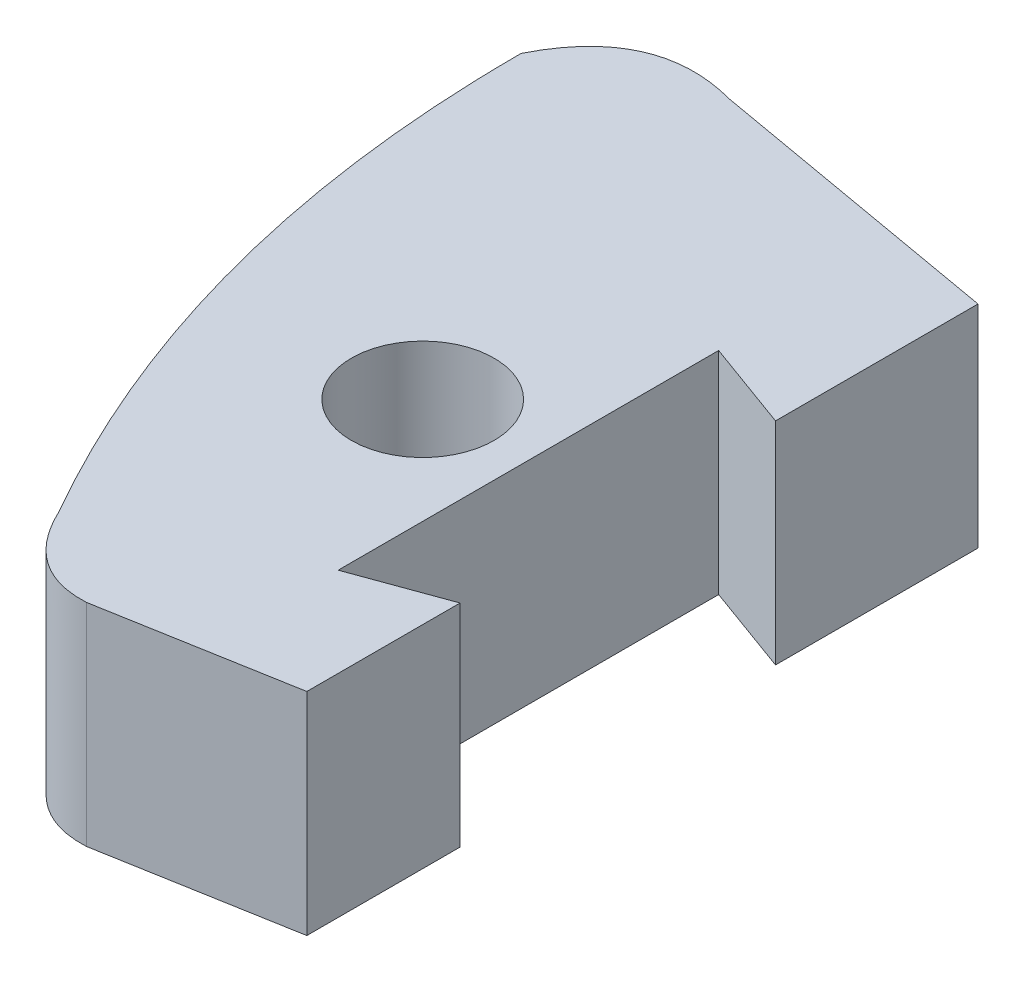
ISO-10303-21;
HEADER;
FILE_DESCRIPTION(('STEP AP214'),'2;1');
FILE_NAME('part.step','',(''),(''),'','','');
FILE_SCHEMA(('AUTOMOTIVE_DESIGN { 1 0 10303 214 1 1 1 1 }'));
ENDSEC;
DATA;
#1=APPLICATION_CONTEXT('core data for automotive mechanical design processes');
#2=APPLICATION_PROTOCOL_DEFINITION('international standard','automotive_design',2000,#1);
#3=PRODUCT_CONTEXT('',#1,'mechanical');
#4=PRODUCT('Part','Part','',(#3));
#5=PRODUCT_RELATED_PRODUCT_CATEGORY('part','',(#4));
#6=PRODUCT_DEFINITION_FORMATION('','',#4);
#7=PRODUCT_DEFINITION_CONTEXT('part definition',#1,'design');
#8=PRODUCT_DEFINITION('design','',#6,#7);
#9=PRODUCT_DEFINITION_SHAPE('','',#8);
#10=(LENGTH_UNIT() NAMED_UNIT(*) SI_UNIT(.MILLI.,.METRE.));
#11=(NAMED_UNIT(*) PLANE_ANGLE_UNIT() SI_UNIT($,.RADIAN.));
#12=(NAMED_UNIT(*) SI_UNIT($,.STERADIAN.) SOLID_ANGLE_UNIT());
#13=UNCERTAINTY_MEASURE_WITH_UNIT(LENGTH_MEASURE(1.E-05),#10,'distance_accuracy_value','');
#14=(GEOMETRIC_REPRESENTATION_CONTEXT(3) GLOBAL_UNCERTAINTY_ASSIGNED_CONTEXT((#13)) GLOBAL_UNIT_ASSIGNED_CONTEXT((#10,
#11,#12)) REPRESENTATION_CONTEXT('',''));
#15=CARTESIAN_POINT('',(0.,0.,0.));
#16=DIRECTION('',(0.,0.,1.));
#17=DIRECTION('',(1.,0.,0.));
#18=AXIS2_PLACEMENT_3D('',#15,#16,#17);
#19=CARTESIAN_POINT('',(-4.2144044616137,2.,-6.24242929738328));
#20=CARTESIAN_POINT('',(-3.78290886080091,2.,-7.1045543862134));
#21=CARTESIAN_POINT('',(-2.85594248373541,2.,-6.85357971523409));
#22=B_SPLINE_CURVE_WITH_KNOTS('',2,(#19,#20,#21),.UNSPECIFIED.,.F.,.F.,(3,3),(0.,1.),.UNSPECIFIED.);
#23=DIRECTION('',(0.,-1.,0.));
#24=VECTOR('',#23,1.);
#25=SURFACE_OF_LINEAR_EXTRUSION('',#22,#24);
#26=CARTESIAN_POINT('',(-4.2144044616137,0.,-6.24242929738328));
#27=CARTESIAN_POINT('',(-3.78290886080091,0.,-7.1045543862134));
#28=CARTESIAN_POINT('',(-2.85594248373541,0.,-6.85357971523409));
#29=B_SPLINE_CURVE_WITH_KNOTS('',2,(#26,#27,#28),.UNSPECIFIED.,.F.,.F.,(3,3),(0.,1.),.UNSPECIFIED.);
#30=CARTESIAN_POINT('',(-4.2144044616137,0.,-6.24242929738328));
#31=VERTEX_POINT('',#30);
#32=CARTESIAN_POINT('',(-2.85594248373541,0.,-6.85357971523409));
#33=VERTEX_POINT('',#32);
#34=EDGE_CURVE('E170',#31,#33,#29,.T.);
#35=ORIENTED_EDGE('',*,*,#34,.F.);
#36=DIRECTION('',(0.,-1.,0.));
#37=VECTOR('',#36,1.);
#38=CARTESIAN_POINT('',(-4.2144044616137,2.,-6.24242929738328));
#39=LINE('',#38,#37);
#40=CARTESIAN_POINT('',(-4.2144044616137,2.,-6.24242929738328));
#41=VERTEX_POINT('',#40);
#42=EDGE_CURVE('E11',#41,#31,#39,.T.);
#43=ORIENTED_EDGE('',*,*,#42,.F.);
#44=CARTESIAN_POINT('',(-2.85594248373541,2.,-6.85357971523409));
#45=VERTEX_POINT('',#44);
#46=EDGE_CURVE('E217',#41,#45,#22,.T.);
#47=ORIENTED_EDGE('',*,*,#46,.T.);
#48=DIRECTION('',(0.,-1.,0.));
#49=VECTOR('',#48,1.);
#50=CARTESIAN_POINT('',(-2.85594248373541,2.,-6.85357971523409));
#51=LINE('',#50,#49);
#52=EDGE_CURVE('E93',#45,#33,#51,.T.);
#53=ORIENTED_EDGE('',*,*,#52,.T.);
#54=EDGE_LOOP('',(#35,#43,#47,#53));
#55=FACE_BOUND('',#54,.T.);
#56=ADVANCED_FACE('F36',(#55),#25,.T.);
#57=CARTESIAN_POINT('',(-2.64685310114032,2.,-0.302878760546132));
#58=CARTESIAN_POINT('',(-4.21704652494037,2.,-3.04262938124711));
#59=CARTESIAN_POINT('',(-4.2144044616137,2.,-6.24242929738328));
#60=B_SPLINE_CURVE_WITH_KNOTS('',2,(#57,#58,#59),.UNSPECIFIED.,.F.,.F.,(3,3),(0.,1.),.UNSPECIFIED.);
#61=DIRECTION('',(0.,-1.,0.));
#62=VECTOR('',#61,1.);
#63=SURFACE_OF_LINEAR_EXTRUSION('',#60,#62);
#64=CARTESIAN_POINT('',(-2.64685310114032,0.,-0.302878760546132));
#65=CARTESIAN_POINT('',(-4.21704652494037,0.,-3.04262938124711));
#66=CARTESIAN_POINT('',(-4.2144044616137,0.,-6.24242929738328));
#67=B_SPLINE_CURVE_WITH_KNOTS('',2,(#64,#65,#66),.UNSPECIFIED.,.F.,.F.,(3,3),(0.,1.),.UNSPECIFIED.);
#68=CARTESIAN_POINT('',(-2.64685310114032,0.,-0.302878760546132));
#69=VERTEX_POINT('',#68);
#70=EDGE_CURVE('E168',#69,#31,#67,.T.);
#71=ORIENTED_EDGE('',*,*,#70,.F.);
#72=DIRECTION('',(0.,-1.,0.));
#73=VECTOR('',#72,1.);
#74=CARTESIAN_POINT('',(-2.64685310114032,2.,-0.302878760546132));
#75=LINE('',#74,#73);
#76=CARTESIAN_POINT('',(-2.64685310114032,2.,-0.302878760546132));
#77=VERTEX_POINT('',#76);
#78=EDGE_CURVE('E45',#77,#69,#75,.T.);
#79=ORIENTED_EDGE('',*,*,#78,.F.);
#80=EDGE_CURVE('E222',#77,#41,#60,.T.);
#81=ORIENTED_EDGE('',*,*,#80,.T.);
#82=ORIENTED_EDGE('',*,*,#42,.T.);
#83=EDGE_LOOP('',(#71,#79,#81,#82));
#84=FACE_BOUND('',#83,.T.);
#85=ADVANCED_FACE('F169',(#84),#63,.T.);
#86=CARTESIAN_POINT('',(-1.77265395542198,2.,0.312566719800469));
#87=CARTESIAN_POINT('',(-2.34293298287558,2.,0.342253747651418));
#88=CARTESIAN_POINT('',(-2.64685310114032,2.,-0.302878760546132));
#89=B_SPLINE_CURVE_WITH_KNOTS('',2,(#86,#87,#88),.UNSPECIFIED.,.F.,.F.,(3,3),(0.,1.),.UNSPECIFIED.);
#90=DIRECTION('',(0.,-1.,0.));
#91=VECTOR('',#90,1.);
#92=SURFACE_OF_LINEAR_EXTRUSION('',#89,#91);
#93=CARTESIAN_POINT('',(-1.77265395542198,0.,0.312566719800469));
#94=CARTESIAN_POINT('',(-2.34293298287558,0.,0.342253747651418));
#95=CARTESIAN_POINT('',(-2.64685310114032,0.,-0.302878760546132));
#96=B_SPLINE_CURVE_WITH_KNOTS('',2,(#93,#94,#95),.UNSPECIFIED.,.F.,.F.,(3,3),(0.,1.),.UNSPECIFIED.);
#97=CARTESIAN_POINT('',(-1.77265395542198,0.,0.312566719800469));
#98=VERTEX_POINT('',#97);
#99=EDGE_CURVE('E161',#98,#69,#96,.T.);
#100=ORIENTED_EDGE('',*,*,#99,.F.);
#101=DIRECTION('',(0.,-1.,0.));
#102=VECTOR('',#101,1.);
#103=CARTESIAN_POINT('',(-1.77265395542198,2.,0.312566719800469));
#104=LINE('',#103,#102);
#105=CARTESIAN_POINT('',(-1.77265395542198,2.,0.312566719800469));
#106=VERTEX_POINT('',#105);
#107=EDGE_CURVE('E154',#106,#98,#104,.T.);
#108=ORIENTED_EDGE('',*,*,#107,.F.);
#109=EDGE_CURVE('E163',#106,#77,#89,.T.);
#110=ORIENTED_EDGE('',*,*,#109,.T.);
#111=ORIENTED_EDGE('',*,*,#78,.T.);
#112=EDGE_LOOP('',(#100,#108,#110,#111));
#113=FACE_BOUND('',#112,.T.);
#114=ADVANCED_FACE('F159',(#113),#92,.T.);
#115=CARTESIAN_POINT('',(0.,2.,0.));
#116=DIRECTION('',(-0.173648177666927,0.,-0.984807753012209));
#117=DIRECTION('',(-0.984807753012209,0.,0.173648177666927));
#118=AXIS2_PLACEMENT_3D('',#115,#116,#117);
#119=PLANE('',#118);
#120=DIRECTION('',(0.984807753012209,0.,-0.173648177666927));
#121=VECTOR('',#120,1.);
#122=CARTESIAN_POINT('',(0.,0.,0.));
#123=LINE('',#122,#121);
#124=CARTESIAN_POINT('',(0.,0.,0.));
#125=VERTEX_POINT('',#124);
#126=EDGE_CURVE('E175',#98,#125,#123,.T.);
#127=ORIENTED_EDGE('',*,*,#126,.T.);
#128=DIRECTION('',(0.,-1.,0.));
#129=VECTOR('',#128,1.);
#130=CARTESIAN_POINT('',(0.,2.,0.));
#131=LINE('',#130,#129);
#132=CARTESIAN_POINT('',(0.,2.,0.));
#133=VERTEX_POINT('',#132);
#134=EDGE_CURVE('E151',#133,#125,#131,.T.);
#135=ORIENTED_EDGE('',*,*,#134,.F.);
#136=DIRECTION('',(0.984807753012209,0.,-0.173648177666927));
#137=VECTOR('',#136,1.);
#138=CARTESIAN_POINT('',(0.,2.,0.));
#139=LINE('',#138,#137);
#140=EDGE_CURVE('E237',#106,#133,#139,.T.);
#141=ORIENTED_EDGE('',*,*,#140,.F.);
#142=ORIENTED_EDGE('',*,*,#107,.T.);
#143=EDGE_LOOP('',(#127,#135,#141,#142));
#144=FACE_BOUND('',#143,.T.);
#145=ADVANCED_FACE('F243',(#144),#119,.F.);
#146=CARTESIAN_POINT('',(0.,2.,0.));
#147=DIRECTION('',(-1.,0.,0.));
#148=DIRECTION('',(0.,0.,1.));
#149=AXIS2_PLACEMENT_3D('',#146,#147,#148);
#150=PLANE('',#149);
#151=DIRECTION('',(0.,0.,-1.));
#152=VECTOR('',#151,1.);
#153=CARTESIAN_POINT('',(0.,0.,0.));
#154=LINE('',#153,#152);
#155=CARTESIAN_POINT('',(0.,0.,-1.45));
#156=VERTEX_POINT('',#155);
#157=EDGE_CURVE('E177',#125,#156,#154,.T.);
#158=ORIENTED_EDGE('',*,*,#157,.T.);
#159=DIRECTION('',(0.,-1.,0.));
#160=VECTOR('',#159,1.);
#161=CARTESIAN_POINT('',(0.,2.,-1.45));
#162=LINE('',#161,#160);
#163=CARTESIAN_POINT('',(0.,2.,-1.45));
#164=VERTEX_POINT('',#163);
#165=EDGE_CURVE('E148',#164,#156,#162,.T.);
#166=ORIENTED_EDGE('',*,*,#165,.F.);
#167=DIRECTION('',(0.,0.,-1.));
#168=VECTOR('',#167,1.);
#169=CARTESIAN_POINT('',(0.,2.,0.));
#170=LINE('',#169,#168);
#171=EDGE_CURVE('E128',#133,#164,#170,.T.);
#172=ORIENTED_EDGE('',*,*,#171,.F.);
#173=ORIENTED_EDGE('',*,*,#134,.T.);
#174=EDGE_LOOP('',(#158,#166,#172,#173));
#175=FACE_BOUND('',#174,.T.);
#176=ADVANCED_FACE('F246',(#175),#150,.F.);
#177=CARTESIAN_POINT('',(-0.466021017022746,2.,-1.28038222126126));
#178=DIRECTION('',(0.342020143325673,0.,0.939692620785907));
#179=DIRECTION('',(0.939692620785907,0.,-0.342020143325673));
#180=AXIS2_PLACEMENT_3D('',#177,#178,#179);
#181=PLANE('',#180);
#182=DIRECTION('',(-0.939692620785907,0.,0.342020143325673));
#183=VECTOR('',#182,1.);
#184=CARTESIAN_POINT('',(-0.466021017022746,0.,-1.28038222126126));
#185=LINE('',#184,#183);
#186=CARTESIAN_POINT('',(-0.845723358707316,0.,-1.14218187100689));
#187=VERTEX_POINT('',#186);
#188=EDGE_CURVE('E190',#156,#187,#185,.T.);
#189=ORIENTED_EDGE('',*,*,#188,.T.);
#190=DIRECTION('',(0.,-1.,0.));
#191=VECTOR('',#190,1.);
#192=CARTESIAN_POINT('',(-0.845723358707316,2.,-1.14218187100689));
#193=LINE('',#192,#191);
#194=CARTESIAN_POINT('',(-0.845723358707316,2.,-1.14218187100689));
#195=VERTEX_POINT('',#194);
#196=EDGE_CURVE('E141',#195,#187,#193,.T.);
#197=ORIENTED_EDGE('',*,*,#196,.F.);
#198=DIRECTION('',(-0.939692620785907,0.,0.342020143325673));
#199=VECTOR('',#198,1.);
#200=CARTESIAN_POINT('',(-0.466021017022746,2.,-1.28038222126126));
#201=LINE('',#200,#199);
#202=EDGE_CURVE('E356',#164,#195,#201,.T.);
#203=ORIENTED_EDGE('',*,*,#202,.F.);
#204=ORIENTED_EDGE('',*,*,#165,.T.);
#205=EDGE_LOOP('',(#189,#197,#203,#204));
#206=FACE_BOUND('',#205,.T.);
#207=ADVANCED_FACE('F248',(#206),#181,.F.);
#208=CARTESIAN_POINT('',(-0.845723358707316,2.,0.));
#209=DIRECTION('',(-1.,0.,0.));
#210=DIRECTION('',(0.,0.,1.));
#211=AXIS2_PLACEMENT_3D('',#208,#209,#210);
#212=PLANE('',#211);
#213=DIRECTION('',(0.,0.,-1.));
#214=VECTOR('',#213,1.);
#215=CARTESIAN_POINT('',(-0.845723358707316,0.,0.));
#216=LINE('',#215,#214);
#217=CARTESIAN_POINT('',(-0.845723358707316,0.,-4.74218187100689));
#218=VERTEX_POINT('',#217);
#219=EDGE_CURVE('E194',#187,#218,#216,.T.);
#220=ORIENTED_EDGE('',*,*,#219,.T.);
#221=DIRECTION('',(0.,-1.,0.));
#222=VECTOR('',#221,1.);
#223=CARTESIAN_POINT('',(-0.845723358707316,2.,-4.74218187100689));
#224=LINE('',#223,#222);
#225=CARTESIAN_POINT('',(-0.845723358707316,2.,-4.74218187100689));
#226=VERTEX_POINT('',#225);
#227=EDGE_CURVE('E139',#226,#218,#224,.T.);
#228=ORIENTED_EDGE('',*,*,#227,.F.);
#229=DIRECTION('',(0.,0.,-1.));
#230=VECTOR('',#229,1.);
#231=CARTESIAN_POINT('',(-0.845723358707316,2.,0.));
#232=LINE('',#231,#230);
#233=EDGE_CURVE('E132',#195,#226,#232,.T.);
#234=ORIENTED_EDGE('',*,*,#233,.F.);
#235=ORIENTED_EDGE('',*,*,#196,.T.);
#236=EDGE_LOOP('',(#220,#228,#234,#235));
#237=FACE_BOUND('',#236,.T.);
#238=ADVANCED_FACE('F251',(#237),#212,.F.);
#239=CARTESIAN_POINT('',(1.42517703510486,2.,-3.91564172267586));
#240=DIRECTION('',(0.342020143325671,0.,-0.939692620785908));
#241=DIRECTION('',(-0.939692620785908,0.,-0.342020143325671));
#242=AXIS2_PLACEMENT_3D('',#239,#240,#241);
#243=PLANE('',#242);
#244=DIRECTION('',(0.939692620785908,0.,0.342020143325671));
#245=VECTOR('',#244,1.);
#246=CARTESIAN_POINT('',(1.42517703510486,0.,-3.91564172267586));
#247=LINE('',#246,#245);
#248=CARTESIAN_POINT('',(0.,0.,-4.43436374201379));
#249=VERTEX_POINT('',#248);
#250=EDGE_CURVE('E138',#218,#249,#247,.T.);
#251=ORIENTED_EDGE('',*,*,#250,.T.);
#252=DIRECTION('',(0.,-1.,0.));
#253=VECTOR('',#252,1.);
#254=CARTESIAN_POINT('',(0.,2.,-4.43436374201379));
#255=LINE('',#254,#253);
#256=CARTESIAN_POINT('',(0.,2.,-4.43436374201379));
#257=VERTEX_POINT('',#256);
#258=EDGE_CURVE('E123',#257,#249,#255,.T.);
#259=ORIENTED_EDGE('',*,*,#258,.F.);
#260=DIRECTION('',(0.939692620785908,0.,0.342020143325671));
#261=VECTOR('',#260,1.);
#262=CARTESIAN_POINT('',(1.42517703510486,2.,-3.91564172267586));
#263=LINE('',#262,#261);
#264=EDGE_CURVE('E126',#226,#257,#263,.T.);
#265=ORIENTED_EDGE('',*,*,#264,.F.);
#266=ORIENTED_EDGE('',*,*,#227,.T.);
#267=EDGE_LOOP('',(#251,#259,#265,#266));
#268=FACE_BOUND('',#267,.T.);
#269=ADVANCED_FACE('F137',(#268),#243,.F.);
#270=CARTESIAN_POINT('',(0.,0.,-6.35));
#271=VERTEX_POINT('',#270);
#272=EDGE_CURVE('E191',#249,#271,#154,.T.);
#273=ORIENTED_EDGE('',*,*,#272,.T.);
#274=DIRECTION('',(0.,-1.,0.));
#275=VECTOR('',#274,1.);
#276=CARTESIAN_POINT('',(0.,2.,-6.35));
#277=LINE('',#276,#275);
#278=CARTESIAN_POINT('',(0.,2.,-6.35));
#279=VERTEX_POINT('',#278);
#280=EDGE_CURVE('E125',#279,#271,#277,.T.);
#281=ORIENTED_EDGE('',*,*,#280,.F.);
#282=EDGE_CURVE('E118',#257,#279,#170,.T.);
#283=ORIENTED_EDGE('',*,*,#282,.F.);
#284=ORIENTED_EDGE('',*,*,#258,.T.);
#285=EDGE_LOOP('',(#273,#281,#283,#284));
#286=FACE_BOUND('',#285,.T.);
#287=ADVANCED_FACE('F121',(#286),#150,.F.);
#288=CARTESIAN_POINT('',(-1.84572335870732,2.,-2.94218187100689));
#289=DIRECTION('',(0.,-1.,0.));
#290=DIRECTION('',(0.,0.,-1.));
#291=AXIS2_PLACEMENT_3D('',#288,#289,#290);
#292=CYLINDRICAL_SURFACE('',#291,0.675);
#293=CARTESIAN_POINT('',(-1.84572335870732,2.,-2.94218187100689));
#294=DIRECTION('',(0.,1.,0.));
#295=DIRECTION('',(0.,0.,1.));
#296=AXIS2_PLACEMENT_3D('',#293,#294,#295);
#297=CIRCLE('',#296,0.675);
#298=CARTESIAN_POINT('',(-1.84572335870732,2.,-2.26718187100689));
#299=VERTEX_POINT('',#298);
#300=EDGE_CURVE('E198',#299,#299,#297,.T.);
#301=ORIENTED_EDGE('',*,*,#300,.T.);
#302=EDGE_LOOP('',(#301));
#303=FACE_BOUND('',#302,.T.);
#304=CARTESIAN_POINT('',(-1.84572335870732,0.,-2.94218187100689));
#305=DIRECTION('',(0.,1.,0.));
#306=DIRECTION('',(0.,0.,1.));
#307=AXIS2_PLACEMENT_3D('',#304,#305,#306);
#308=CIRCLE('',#307,0.675);
#309=CARTESIAN_POINT('',(-1.84572335870732,0.,-2.26718187100689));
#310=VERTEX_POINT('',#309);
#311=EDGE_CURVE('E202',#310,#310,#308,.T.);
#312=ORIENTED_EDGE('',*,*,#311,.F.);
#313=EDGE_LOOP('',(#312));
#314=FACE_BOUND('',#313,.T.);
#315=ADVANCED_FACE('F38',(#303,#314),#292,.F.);
#316=CARTESIAN_POINT('',(1.08591395505897,2.,-6.15852407099527));
#317=DIRECTION('',(-0.173648177666926,0.,0.984807753012209));
#318=DIRECTION('',(0.984807753012209,0.,0.173648177666927));
#319=AXIS2_PLACEMENT_3D('',#316,#317,#318);
#320=PLANE('',#319);
#321=DIRECTION('',(-0.984807753012209,0.,-0.173648177666927));
#322=VECTOR('',#321,1.);
#323=CARTESIAN_POINT('',(1.08591395505897,0.,-6.15852407099527));
#324=LINE('',#323,#322);
#325=EDGE_CURVE('E86',#271,#33,#324,.T.);
#326=ORIENTED_EDGE('',*,*,#325,.T.);
#327=ORIENTED_EDGE('',*,*,#52,.F.);
#328=DIRECTION('',(-0.984807753012209,0.,-0.173648177666927));
#329=VECTOR('',#328,1.);
#330=CARTESIAN_POINT('',(1.08591395505897,2.,-6.15852407099527));
#331=LINE('',#330,#329);
#332=EDGE_CURVE('E53',#279,#45,#331,.T.);
#333=ORIENTED_EDGE('',*,*,#332,.F.);
#334=ORIENTED_EDGE('',*,*,#280,.T.);
#335=EDGE_LOOP('',(#326,#327,#333,#334));
#336=FACE_BOUND('',#335,.T.);
#337=ADVANCED_FACE('F260',(#336),#320,.F.);
#338=CARTESIAN_POINT('',(0.,2.,0.));
#339=DIRECTION('',(0.,1.,0.));
#340=DIRECTION('',(0.,0.,1.));
#341=AXIS2_PLACEMENT_3D('',#338,#339,#340);
#342=PLANE('',#341);
#343=ORIENTED_EDGE('',*,*,#300,.F.);
#344=EDGE_LOOP('',(#343));
#345=FACE_BOUND('',#344,.T.);
#346=ORIENTED_EDGE('',*,*,#46,.F.);
#347=ORIENTED_EDGE('',*,*,#80,.F.);
#348=ORIENTED_EDGE('',*,*,#109,.F.);
#349=ORIENTED_EDGE('',*,*,#140,.T.);
#350=ORIENTED_EDGE('',*,*,#171,.T.);
#351=ORIENTED_EDGE('',*,*,#202,.T.);
#352=ORIENTED_EDGE('',*,*,#233,.T.);
#353=ORIENTED_EDGE('',*,*,#264,.T.);
#354=ORIENTED_EDGE('',*,*,#282,.T.);
#355=ORIENTED_EDGE('',*,*,#332,.T.);
#356=EDGE_LOOP('',(#346,#347,#348,#349,#350,#351,#352,#353,#354,#355));
#357=FACE_BOUND('',#356,.T.);
#358=ADVANCED_FACE('F130',(#345,#357),#342,.T.);
#359=CARTESIAN_POINT('',(0.,0.,0.));
#360=DIRECTION('',(0.,1.,0.));
#361=DIRECTION('',(0.,0.,1.));
#362=AXIS2_PLACEMENT_3D('',#359,#360,#361);
#363=PLANE('',#362);
#364=ORIENTED_EDGE('',*,*,#311,.T.);
#365=EDGE_LOOP('',(#364));
#366=FACE_BOUND('',#365,.T.);
#367=ORIENTED_EDGE('',*,*,#34,.T.);
#368=ORIENTED_EDGE('',*,*,#325,.F.);
#369=ORIENTED_EDGE('',*,*,#272,.F.);
#370=ORIENTED_EDGE('',*,*,#250,.F.);
#371=ORIENTED_EDGE('',*,*,#219,.F.);
#372=ORIENTED_EDGE('',*,*,#188,.F.);
#373=ORIENTED_EDGE('',*,*,#157,.F.);
#374=ORIENTED_EDGE('',*,*,#126,.F.);
#375=ORIENTED_EDGE('',*,*,#99,.T.);
#376=ORIENTED_EDGE('',*,*,#70,.T.);
#377=EDGE_LOOP('',(#367,#368,#369,#370,#371,#372,#373,#374,#375,#376));
#378=FACE_BOUND('',#377,.T.);
#379=ADVANCED_FACE('F173',(#366,#378),#363,.F.);
#380=CLOSED_SHELL('',(#56,#85,#114,#145,#176,#207,#238,#269,#287,#315,#337,#358,#379));
#381=MANIFOLD_SOLID_BREP('B2',#380);
#382=ADVANCED_BREP_SHAPE_REPRESENTATION('',(#18,#381),#14);
#383=SHAPE_DEFINITION_REPRESENTATION(#9,#382);
ENDSEC;
END-ISO-10303-21;
